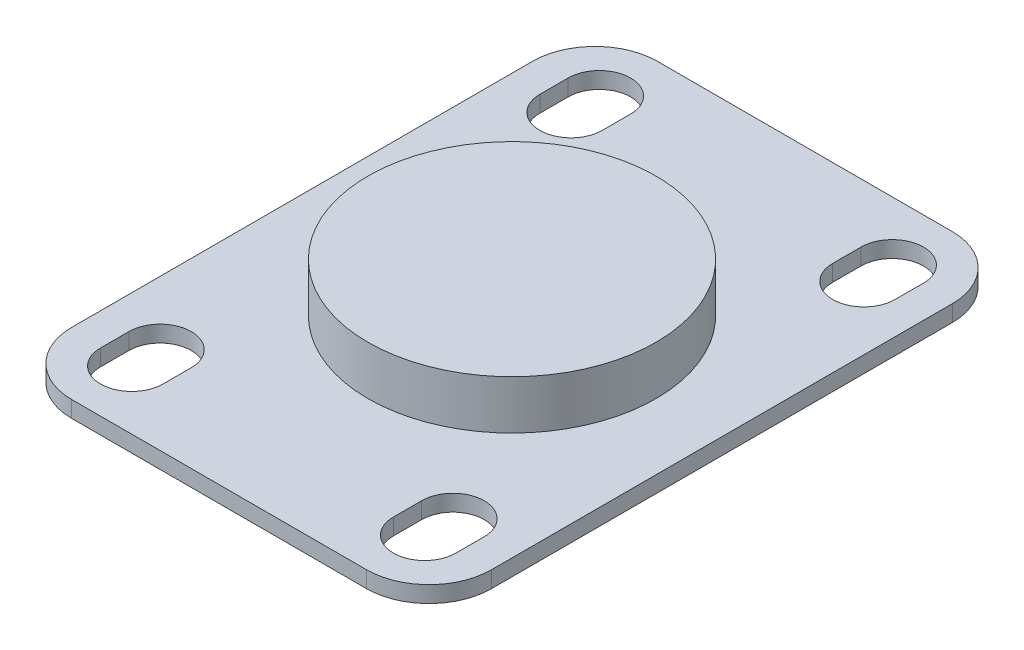
ISO-10303-21;
HEADER;
FILE_DESCRIPTION(('STEP AP214'),'2;1');
FILE_NAME('part.step','',(''),(''),'','','');
FILE_SCHEMA(('AUTOMOTIVE_DESIGN { 1 0 10303 214 1 1 1 1 }'));
ENDSEC;
DATA;
#1=APPLICATION_CONTEXT('core data for automotive mechanical design processes');
#2=APPLICATION_PROTOCOL_DEFINITION('international standard','automotive_design',2000,#1);
#3=PRODUCT_CONTEXT('',#1,'mechanical');
#4=PRODUCT('Part','Part','',(#3));
#5=PRODUCT_RELATED_PRODUCT_CATEGORY('part','',(#4));
#6=PRODUCT_DEFINITION_FORMATION('','',#4);
#7=PRODUCT_DEFINITION_CONTEXT('part definition',#1,'design');
#8=PRODUCT_DEFINITION('design','',#6,#7);
#9=PRODUCT_DEFINITION_SHAPE('','',#8);
#10=(LENGTH_UNIT() NAMED_UNIT(*) SI_UNIT(.MILLI.,.METRE.));
#11=(NAMED_UNIT(*) PLANE_ANGLE_UNIT() SI_UNIT($,.RADIAN.));
#12=(NAMED_UNIT(*) SI_UNIT($,.STERADIAN.) SOLID_ANGLE_UNIT());
#13=UNCERTAINTY_MEASURE_WITH_UNIT(LENGTH_MEASURE(1.E-05),#10,'distance_accuracy_value','');
#14=(GEOMETRIC_REPRESENTATION_CONTEXT(3) GLOBAL_UNCERTAINTY_ASSIGNED_CONTEXT((#13)) GLOBAL_UNIT_ASSIGNED_CONTEXT((#10,
#11,#12)) REPRESENTATION_CONTEXT('',''));
#15=CARTESIAN_POINT('',(0.,0.,0.));
#16=DIRECTION('',(0.,0.,1.));
#17=DIRECTION('',(1.,0.,0.));
#18=AXIS2_PLACEMENT_3D('',#15,#16,#17);
#19=CARTESIAN_POINT('',(-15.,1.68,-21.05));
#20=DIRECTION('',(0.,-1.,0.));
#21=DIRECTION('',(0.,0.,-1.));
#22=AXIS2_PLACEMENT_3D('',#19,#20,#21);
#23=CYLINDRICAL_SURFACE('',#22,3.2);
#24=CARTESIAN_POINT('',(-15.,0.,-21.05));
#25=DIRECTION('',(0.,1.,0.));
#26=DIRECTION('',(0.,0.,1.));
#27=AXIS2_PLACEMENT_3D('',#24,#25,#26);
#28=CIRCLE('',#27,3.2);
#29=CARTESIAN_POINT('',(-18.2,0.,-21.05));
#30=VERTEX_POINT('',#29);
#31=CARTESIAN_POINT('',(-11.8,0.,-21.05));
#32=VERTEX_POINT('',#31);
#33=EDGE_CURVE('E344',#30,#32,#28,.T.);
#34=ORIENTED_EDGE('',*,*,#33,.F.);
#35=DIRECTION('',(0.,-1.,0.));
#36=VECTOR('',#35,1.);
#37=CARTESIAN_POINT('',(-18.2,1.68,-21.05));
#38=LINE('',#37,#36);
#39=CARTESIAN_POINT('',(-18.2,1.68,-21.05));
#40=VERTEX_POINT('',#39);
#41=EDGE_CURVE('E11',#40,#30,#38,.T.);
#42=ORIENTED_EDGE('',*,*,#41,.F.);
#43=CARTESIAN_POINT('',(-15.,1.68,-21.05));
#44=DIRECTION('',(0.,1.,0.));
#45=DIRECTION('',(0.,0.,1.));
#46=AXIS2_PLACEMENT_3D('',#43,#44,#45);
#47=CIRCLE('',#46,3.2);
#48=CARTESIAN_POINT('',(-11.8,1.68,-21.05));
#49=VERTEX_POINT('',#48);
#50=EDGE_CURVE('E218',#40,#49,#47,.T.);
#51=ORIENTED_EDGE('',*,*,#50,.T.);
#52=DIRECTION('',(0.,-1.,0.));
#53=VECTOR('',#52,1.);
#54=CARTESIAN_POINT('',(-11.8,1.68,-21.05));
#55=LINE('',#54,#53);
#56=EDGE_CURVE('E56',#49,#32,#55,.T.);
#57=ORIENTED_EDGE('',*,*,#56,.T.);
#58=EDGE_LOOP('',(#34,#42,#51,#57));
#59=FACE_BOUND('',#58,.T.);
#60=ADVANCED_FACE('F37',(#59),#23,.F.);
#61=CARTESIAN_POINT('',(-18.2,1.68,0.));
#62=DIRECTION('',(-1.,0.,0.));
#63=DIRECTION('',(0.,0.,1.));
#64=AXIS2_PLACEMENT_3D('',#61,#62,#63);
#65=PLANE('',#64);
#66=DIRECTION('',(0.,0.,-1.));
#67=VECTOR('',#66,1.);
#68=CARTESIAN_POINT('',(-18.2,0.,0.));
#69=LINE('',#68,#67);
#70=CARTESIAN_POINT('',(-18.2,0.,-23.95));
#71=VERTEX_POINT('',#70);
#72=EDGE_CURVE('E223',#30,#71,#69,.T.);
#73=ORIENTED_EDGE('',*,*,#72,.T.);
#74=DIRECTION('',(0.,-1.,0.));
#75=VECTOR('',#74,1.);
#76=CARTESIAN_POINT('',(-18.2,1.68,-23.95));
#77=LINE('',#76,#75);
#78=CARTESIAN_POINT('',(-18.2,1.68,-23.95));
#79=VERTEX_POINT('',#78);
#80=EDGE_CURVE('E47',#79,#71,#77,.T.);
#81=ORIENTED_EDGE('',*,*,#80,.F.);
#82=DIRECTION('',(0.,0.,-1.));
#83=VECTOR('',#82,1.);
#84=CARTESIAN_POINT('',(-18.2,1.68,0.));
#85=LINE('',#84,#83);
#86=EDGE_CURVE('E213',#40,#79,#85,.T.);
#87=ORIENTED_EDGE('',*,*,#86,.F.);
#88=ORIENTED_EDGE('',*,*,#41,.T.);
#89=EDGE_LOOP('',(#73,#81,#87,#88));
#90=FACE_BOUND('',#89,.T.);
#91=ADVANCED_FACE('F221',(#90),#65,.F.);
#92=CARTESIAN_POINT('',(-15.,1.68,-23.95));
#93=DIRECTION('',(0.,-1.,0.));
#94=DIRECTION('',(0.,0.,-1.));
#95=AXIS2_PLACEMENT_3D('',#92,#93,#94);
#96=CYLINDRICAL_SURFACE('',#95,3.2);
#97=CARTESIAN_POINT('',(-15.,0.,-23.95));
#98=DIRECTION('',(0.,1.,0.));
#99=DIRECTION('',(0.,0.,1.));
#100=AXIS2_PLACEMENT_3D('',#97,#98,#99);
#101=CIRCLE('',#100,3.2);
#102=CARTESIAN_POINT('',(-11.8,0.,-23.95));
#103=VERTEX_POINT('',#102);
#104=EDGE_CURVE('E347',#71,#103,#101,.F.);
#105=ORIENTED_EDGE('',*,*,#104,.T.);
#106=DIRECTION('',(0.,-1.,0.));
#107=VECTOR('',#106,1.);
#108=CARTESIAN_POINT('',(-11.8,1.68,-23.95));
#109=LINE('',#108,#107);
#110=CARTESIAN_POINT('',(-11.8,1.68,-23.95));
#111=VERTEX_POINT('',#110);
#112=EDGE_CURVE('E130',#111,#103,#109,.T.);
#113=ORIENTED_EDGE('',*,*,#112,.F.);
#114=CARTESIAN_POINT('',(-15.,1.68,-23.95));
#115=DIRECTION('',(0.,1.,0.));
#116=DIRECTION('',(0.,0.,1.));
#117=AXIS2_PLACEMENT_3D('',#114,#115,#116);
#118=CIRCLE('',#117,3.2);
#119=EDGE_CURVE('E205',#79,#111,#118,.F.);
#120=ORIENTED_EDGE('',*,*,#119,.F.);
#121=ORIENTED_EDGE('',*,*,#80,.T.);
#122=EDGE_LOOP('',(#105,#113,#120,#121));
#123=FACE_BOUND('',#122,.T.);
#124=ADVANCED_FACE('F207',(#123),#96,.F.);
#125=CARTESIAN_POINT('',(15.,1.68,-23.95));
#126=DIRECTION('',(0.,-1.,0.));
#127=DIRECTION('',(0.,0.,-1.));
#128=AXIS2_PLACEMENT_3D('',#125,#126,#127);
#129=CYLINDRICAL_SURFACE('',#128,3.2);
#130=CARTESIAN_POINT('',(15.,0.,-23.95));
#131=DIRECTION('',(0.,1.,0.));
#132=DIRECTION('',(0.,0.,1.));
#133=AXIS2_PLACEMENT_3D('',#130,#131,#132);
#134=CIRCLE('',#133,3.2);
#135=CARTESIAN_POINT('',(18.2,0.,-23.95));
#136=VERTEX_POINT('',#135);
#137=CARTESIAN_POINT('',(11.8,0.,-23.95));
#138=VERTEX_POINT('',#137);
#139=EDGE_CURVE('E332',#136,#138,#134,.T.);
#140=ORIENTED_EDGE('',*,*,#139,.F.);
#141=DIRECTION('',(0.,-1.,0.));
#142=VECTOR('',#141,1.);
#143=CARTESIAN_POINT('',(18.2,1.68,-23.95));
#144=LINE('',#143,#142);
#145=CARTESIAN_POINT('',(18.2,1.68,-23.95));
#146=VERTEX_POINT('',#145);
#147=EDGE_CURVE('E236',#146,#136,#144,.T.);
#148=ORIENTED_EDGE('',*,*,#147,.F.);
#149=CARTESIAN_POINT('',(15.,1.68,-23.95));
#150=DIRECTION('',(0.,1.,0.));
#151=DIRECTION('',(0.,0.,1.));
#152=AXIS2_PLACEMENT_3D('',#149,#150,#151);
#153=CIRCLE('',#152,3.2);
#154=CARTESIAN_POINT('',(11.8,1.68,-23.95));
#155=VERTEX_POINT('',#154);
#156=EDGE_CURVE('E395',#146,#155,#153,.T.);
#157=ORIENTED_EDGE('',*,*,#156,.T.);
#158=DIRECTION('',(0.,-1.,0.));
#159=VECTOR('',#158,1.);
#160=CARTESIAN_POINT('',(11.8,1.68,-23.95));
#161=LINE('',#160,#159);
#162=EDGE_CURVE('E228',#155,#138,#161,.T.);
#163=ORIENTED_EDGE('',*,*,#162,.T.);
#164=EDGE_LOOP('',(#140,#148,#157,#163));
#165=FACE_BOUND('',#164,.T.);
#166=ADVANCED_FACE('F442',(#165),#129,.F.);
#167=CARTESIAN_POINT('',(18.2,1.68,0.));
#168=DIRECTION('',(-1.,0.,0.));
#169=DIRECTION('',(0.,0.,1.));
#170=AXIS2_PLACEMENT_3D('',#167,#168,#169);
#171=PLANE('',#170);
#172=DIRECTION('',(0.,0.,-1.));
#173=VECTOR('',#172,1.);
#174=CARTESIAN_POINT('',(18.2,0.,0.));
#175=LINE('',#174,#173);
#176=CARTESIAN_POINT('',(18.2,0.,-21.05));
#177=VERTEX_POINT('',#176);
#178=EDGE_CURVE('E335',#177,#136,#175,.T.);
#179=ORIENTED_EDGE('',*,*,#178,.F.);
#180=DIRECTION('',(0.,-1.,0.));
#181=VECTOR('',#180,1.);
#182=CARTESIAN_POINT('',(18.2,1.68,-21.05));
#183=LINE('',#182,#181);
#184=CARTESIAN_POINT('',(18.2,1.68,-21.05));
#185=VERTEX_POINT('',#184);
#186=EDGE_CURVE('E234',#185,#177,#183,.T.);
#187=ORIENTED_EDGE('',*,*,#186,.F.);
#188=DIRECTION('',(0.,0.,-1.));
#189=VECTOR('',#188,1.);
#190=CARTESIAN_POINT('',(18.2,1.68,0.));
#191=LINE('',#190,#189);
#192=EDGE_CURVE('E398',#185,#146,#191,.T.);
#193=ORIENTED_EDGE('',*,*,#192,.T.);
#194=ORIENTED_EDGE('',*,*,#147,.T.);
#195=EDGE_LOOP('',(#179,#187,#193,#194));
#196=FACE_BOUND('',#195,.T.);
#197=ADVANCED_FACE('F438',(#196),#171,.T.);
#198=CARTESIAN_POINT('',(15.,1.68,-21.05));
#199=DIRECTION('',(0.,-1.,0.));
#200=DIRECTION('',(0.,0.,-1.));
#201=AXIS2_PLACEMENT_3D('',#198,#199,#200);
#202=CYLINDRICAL_SURFACE('',#201,3.2);
#203=CARTESIAN_POINT('',(15.,0.,-21.05));
#204=DIRECTION('',(0.,1.,0.));
#205=DIRECTION('',(0.,0.,1.));
#206=AXIS2_PLACEMENT_3D('',#203,#204,#205);
#207=CIRCLE('',#206,3.2);
#208=CARTESIAN_POINT('',(11.8,0.,-21.05));
#209=VERTEX_POINT('',#208);
#210=EDGE_CURVE('E338',#177,#209,#207,.F.);
#211=ORIENTED_EDGE('',*,*,#210,.T.);
#212=DIRECTION('',(0.,-1.,0.));
#213=VECTOR('',#212,1.);
#214=CARTESIAN_POINT('',(11.8,1.68,-21.05));
#215=LINE('',#214,#213);
#216=CARTESIAN_POINT('',(11.8,1.68,-21.05));
#217=VERTEX_POINT('',#216);
#218=EDGE_CURVE('E230',#217,#209,#215,.T.);
#219=ORIENTED_EDGE('',*,*,#218,.F.);
#220=CARTESIAN_POINT('',(15.,1.68,-21.05));
#221=DIRECTION('',(0.,1.,0.));
#222=DIRECTION('',(0.,0.,1.));
#223=AXIS2_PLACEMENT_3D('',#220,#221,#222);
#224=CIRCLE('',#223,3.2);
#225=EDGE_CURVE('E401',#185,#217,#224,.F.);
#226=ORIENTED_EDGE('',*,*,#225,.F.);
#227=ORIENTED_EDGE('',*,*,#186,.T.);
#228=EDGE_LOOP('',(#211,#219,#226,#227));
#229=FACE_BOUND('',#228,.T.);
#230=ADVANCED_FACE('F434',(#229),#202,.F.);
#231=CARTESIAN_POINT('',(15.,1.68,21.05));
#232=DIRECTION('',(0.,-1.,0.));
#233=DIRECTION('',(0.,0.,-1.));
#234=AXIS2_PLACEMENT_3D('',#231,#232,#233);
#235=CYLINDRICAL_SURFACE('',#234,3.2);
#236=CARTESIAN_POINT('',(15.,0.,21.05));
#237=DIRECTION('',(0.,1.,0.));
#238=DIRECTION('',(0.,0.,1.));
#239=AXIS2_PLACEMENT_3D('',#236,#237,#238);
#240=CIRCLE('',#239,3.2);
#241=CARTESIAN_POINT('',(18.2,0.,21.05));
#242=VERTEX_POINT('',#241);
#243=CARTESIAN_POINT('',(11.8,0.,21.05));
#244=VERTEX_POINT('',#243);
#245=EDGE_CURVE('E320',#242,#244,#240,.T.);
#246=ORIENTED_EDGE('',*,*,#245,.F.);
#247=DIRECTION('',(0.,-1.,0.));
#248=VECTOR('',#247,1.);
#249=CARTESIAN_POINT('',(18.2,1.68,21.05));
#250=LINE('',#249,#248);
#251=CARTESIAN_POINT('',(18.2,1.68,21.05));
#252=VERTEX_POINT('',#251);
#253=EDGE_CURVE('E231',#252,#242,#250,.T.);
#254=ORIENTED_EDGE('',*,*,#253,.F.);
#255=CARTESIAN_POINT('',(15.,1.68,21.05));
#256=DIRECTION('',(0.,1.,0.));
#257=DIRECTION('',(0.,0.,1.));
#258=AXIS2_PLACEMENT_3D('',#255,#256,#257);
#259=CIRCLE('',#258,3.2);
#260=CARTESIAN_POINT('',(11.8,1.68,21.05));
#261=VERTEX_POINT('',#260);
#262=EDGE_CURVE('E384',#252,#261,#259,.T.);
#263=ORIENTED_EDGE('',*,*,#262,.T.);
#264=DIRECTION('',(0.,-1.,0.));
#265=VECTOR('',#264,1.);
#266=CARTESIAN_POINT('',(11.8,1.68,21.05));
#267=LINE('',#266,#265);
#268=EDGE_CURVE('E238',#261,#244,#267,.T.);
#269=ORIENTED_EDGE('',*,*,#268,.T.);
#270=EDGE_LOOP('',(#246,#254,#263,#269));
#271=FACE_BOUND('',#270,.T.);
#272=ADVANCED_FACE('F437',(#271),#235,.F.);
#273=CARTESIAN_POINT('',(18.2,1.68,0.));
#274=DIRECTION('',(1.,0.,0.));
#275=DIRECTION('',(0.,0.,-1.));
#276=AXIS2_PLACEMENT_3D('',#273,#274,#275);
#277=PLANE('',#276);
#278=DIRECTION('',(0.,0.,1.));
#279=VECTOR('',#278,1.);
#280=CARTESIAN_POINT('',(18.2,0.,0.));
#281=LINE('',#280,#279);
#282=CARTESIAN_POINT('',(18.2,0.,23.95));
#283=VERTEX_POINT('',#282);
#284=EDGE_CURVE('E323',#242,#283,#281,.T.);
#285=ORIENTED_EDGE('',*,*,#284,.T.);
#286=DIRECTION('',(0.,-1.,0.));
#287=VECTOR('',#286,1.);
#288=CARTESIAN_POINT('',(18.2,1.68,23.95));
#289=LINE('',#288,#287);
#290=CARTESIAN_POINT('',(18.2,1.68,23.95));
#291=VERTEX_POINT('',#290);
#292=EDGE_CURVE('E243',#291,#283,#289,.T.);
#293=ORIENTED_EDGE('',*,*,#292,.F.);
#294=DIRECTION('',(0.,0.,1.));
#295=VECTOR('',#294,1.);
#296=CARTESIAN_POINT('',(18.2,1.68,0.));
#297=LINE('',#296,#295);
#298=EDGE_CURVE('E387',#252,#291,#297,.T.);
#299=ORIENTED_EDGE('',*,*,#298,.F.);
#300=ORIENTED_EDGE('',*,*,#253,.T.);
#301=EDGE_LOOP('',(#285,#293,#299,#300));
#302=FACE_BOUND('',#301,.T.);
#303=ADVANCED_FACE('F454',(#302),#277,.F.);
#304=CARTESIAN_POINT('',(15.,1.68,23.95));
#305=DIRECTION('',(0.,-1.,0.));
#306=DIRECTION('',(0.,0.,-1.));
#307=AXIS2_PLACEMENT_3D('',#304,#305,#306);
#308=CYLINDRICAL_SURFACE('',#307,3.2);
#309=CARTESIAN_POINT('',(15.,0.,23.95));
#310=DIRECTION('',(0.,1.,0.));
#311=DIRECTION('',(0.,0.,1.));
#312=AXIS2_PLACEMENT_3D('',#309,#310,#311);
#313=CIRCLE('',#312,3.2);
#314=CARTESIAN_POINT('',(11.8,0.,23.95));
#315=VERTEX_POINT('',#314);
#316=EDGE_CURVE('E326',#283,#315,#313,.F.);
#317=ORIENTED_EDGE('',*,*,#316,.T.);
#318=DIRECTION('',(0.,-1.,0.));
#319=VECTOR('',#318,1.);
#320=CARTESIAN_POINT('',(11.8,1.68,23.95));
#321=LINE('',#320,#319);
#322=CARTESIAN_POINT('',(11.8,1.68,23.95));
#323=VERTEX_POINT('',#322);
#324=EDGE_CURVE('E240',#323,#315,#321,.T.);
#325=ORIENTED_EDGE('',*,*,#324,.F.);
#326=CARTESIAN_POINT('',(15.,1.68,23.95));
#327=DIRECTION('',(0.,1.,0.));
#328=DIRECTION('',(0.,0.,1.));
#329=AXIS2_PLACEMENT_3D('',#326,#327,#328);
#330=CIRCLE('',#329,3.2);
#331=EDGE_CURVE('E390',#291,#323,#330,.F.);
#332=ORIENTED_EDGE('',*,*,#331,.F.);
#333=ORIENTED_EDGE('',*,*,#292,.T.);
#334=EDGE_LOOP('',(#317,#325,#332,#333));
#335=FACE_BOUND('',#334,.T.);
#336=ADVANCED_FACE('F450',(#335),#308,.F.);
#337=CARTESIAN_POINT('',(-15.,1.68,23.95));
#338=DIRECTION('',(0.,-1.,0.));
#339=DIRECTION('',(0.,0.,-1.));
#340=AXIS2_PLACEMENT_3D('',#337,#338,#339);
#341=CYLINDRICAL_SURFACE('',#340,3.2);
#342=CARTESIAN_POINT('',(-15.,0.,23.95));
#343=DIRECTION('',(0.,1.,0.));
#344=DIRECTION('',(0.,0.,1.));
#345=AXIS2_PLACEMENT_3D('',#342,#343,#344);
#346=CIRCLE('',#345,3.2);
#347=CARTESIAN_POINT('',(-18.2,0.,23.95));
#348=VERTEX_POINT('',#347);
#349=CARTESIAN_POINT('',(-11.8,0.,23.95));
#350=VERTEX_POINT('',#349);
#351=EDGE_CURVE('E308',#348,#350,#346,.T.);
#352=ORIENTED_EDGE('',*,*,#351,.F.);
#353=DIRECTION('',(0.,-1.,0.));
#354=VECTOR('',#353,1.);
#355=CARTESIAN_POINT('',(-18.2,1.68,23.95));
#356=LINE('',#355,#354);
#357=CARTESIAN_POINT('',(-18.2,1.68,23.95));
#358=VERTEX_POINT('',#357);
#359=EDGE_CURVE('E241',#358,#348,#356,.T.);
#360=ORIENTED_EDGE('',*,*,#359,.F.);
#361=CARTESIAN_POINT('',(-15.,1.68,23.95));
#362=DIRECTION('',(0.,1.,0.));
#363=DIRECTION('',(0.,0.,1.));
#364=AXIS2_PLACEMENT_3D('',#361,#362,#363);
#365=CIRCLE('',#364,3.2);
#366=CARTESIAN_POINT('',(-11.8,1.68,23.95));
#367=VERTEX_POINT('',#366);
#368=EDGE_CURVE('E373',#358,#367,#365,.T.);
#369=ORIENTED_EDGE('',*,*,#368,.T.);
#370=DIRECTION('',(0.,-1.,0.));
#371=VECTOR('',#370,1.);
#372=CARTESIAN_POINT('',(-11.8,1.68,23.95));
#373=LINE('',#372,#371);
#374=EDGE_CURVE('E247',#367,#350,#373,.T.);
#375=ORIENTED_EDGE('',*,*,#374,.T.);
#376=EDGE_LOOP('',(#352,#360,#369,#375));
#377=FACE_BOUND('',#376,.T.);
#378=ADVANCED_FACE('F453',(#377),#341,.F.);
#379=CARTESIAN_POINT('',(-18.2,1.68,0.));
#380=DIRECTION('',(1.,0.,0.));
#381=DIRECTION('',(0.,0.,-1.));
#382=AXIS2_PLACEMENT_3D('',#379,#380,#381);
#383=PLANE('',#382);
#384=DIRECTION('',(0.,0.,1.));
#385=VECTOR('',#384,1.);
#386=CARTESIAN_POINT('',(-18.2,0.,0.));
#387=LINE('',#386,#385);
#388=CARTESIAN_POINT('',(-18.2,0.,21.05));
#389=VERTEX_POINT('',#388);
#390=EDGE_CURVE('E311',#389,#348,#387,.T.);
#391=ORIENTED_EDGE('',*,*,#390,.F.);
#392=DIRECTION('',(0.,-1.,0.));
#393=VECTOR('',#392,1.);
#394=CARTESIAN_POINT('',(-18.2,1.68,21.05));
#395=LINE('',#394,#393);
#396=CARTESIAN_POINT('',(-18.2,1.68,21.05));
#397=VERTEX_POINT('',#396);
#398=EDGE_CURVE('E252',#397,#389,#395,.T.);
#399=ORIENTED_EDGE('',*,*,#398,.F.);
#400=DIRECTION('',(0.,0.,1.));
#401=VECTOR('',#400,1.);
#402=CARTESIAN_POINT('',(-18.2,1.68,0.));
#403=LINE('',#402,#401);
#404=EDGE_CURVE('E376',#397,#358,#403,.T.);
#405=ORIENTED_EDGE('',*,*,#404,.T.);
#406=ORIENTED_EDGE('',*,*,#359,.T.);
#407=EDGE_LOOP('',(#391,#399,#405,#406));
#408=FACE_BOUND('',#407,.T.);
#409=ADVANCED_FACE('F468',(#408),#383,.T.);
#410=CARTESIAN_POINT('',(-15.,1.68,21.05));
#411=DIRECTION('',(0.,-1.,0.));
#412=DIRECTION('',(0.,0.,-1.));
#413=AXIS2_PLACEMENT_3D('',#410,#411,#412);
#414=CYLINDRICAL_SURFACE('',#413,3.2);
#415=CARTESIAN_POINT('',(-15.,0.,21.05));
#416=DIRECTION('',(0.,1.,0.));
#417=DIRECTION('',(0.,0.,1.));
#418=AXIS2_PLACEMENT_3D('',#415,#416,#417);
#419=CIRCLE('',#418,3.2);
#420=CARTESIAN_POINT('',(-11.8,0.,21.05));
#421=VERTEX_POINT('',#420);
#422=EDGE_CURVE('E314',#389,#421,#419,.F.);
#423=ORIENTED_EDGE('',*,*,#422,.T.);
#424=DIRECTION('',(0.,-1.,0.));
#425=VECTOR('',#424,1.);
#426=CARTESIAN_POINT('',(-11.8,1.68,21.05));
#427=LINE('',#426,#425);
#428=CARTESIAN_POINT('',(-11.8,1.68,21.05));
#429=VERTEX_POINT('',#428);
#430=EDGE_CURVE('E249',#429,#421,#427,.T.);
#431=ORIENTED_EDGE('',*,*,#430,.F.);
#432=CARTESIAN_POINT('',(-15.,1.68,21.05));
#433=DIRECTION('',(0.,1.,0.));
#434=DIRECTION('',(0.,0.,1.));
#435=AXIS2_PLACEMENT_3D('',#432,#433,#434);
#436=CIRCLE('',#435,3.2);
#437=EDGE_CURVE('E379',#397,#429,#436,.F.);
#438=ORIENTED_EDGE('',*,*,#437,.F.);
#439=ORIENTED_EDGE('',*,*,#398,.T.);
#440=EDGE_LOOP('',(#423,#431,#438,#439));
#441=FACE_BOUND('',#440,.T.);
#442=ADVANCED_FACE('F465',(#441),#414,.F.);
#443=CARTESIAN_POINT('',(-15.1,1.68,-23.6));
#444=DIRECTION('',(0.,-1.,0.));
#445=DIRECTION('',(0.,0.,-1.));
#446=AXIS2_PLACEMENT_3D('',#443,#444,#445);
#447=CYLINDRICAL_SURFACE('',#446,6.4);
#448=CARTESIAN_POINT('',(-15.1,0.,-23.6));
#449=DIRECTION('',(0.,1.,0.));
#450=DIRECTION('',(0.,0.,1.));
#451=AXIS2_PLACEMENT_3D('',#448,#449,#450);
#452=CIRCLE('',#451,6.4);
#453=CARTESIAN_POINT('',(-21.5,0.,-23.5999999999999));
#454=VERTEX_POINT('',#453);
#455=CARTESIAN_POINT('',(-15.0999999999999,0.,-30.));
#456=VERTEX_POINT('',#455);
#457=EDGE_CURVE('E283',#454,#456,#452,.F.);
#458=ORIENTED_EDGE('',*,*,#457,.F.);
#459=DIRECTION('',(0.,-1.,0.));
#460=VECTOR('',#459,1.);
#461=CARTESIAN_POINT('',(-21.5,1.68,-23.5999999999999));
#462=LINE('',#461,#460);
#463=CARTESIAN_POINT('',(-21.5,1.68,-23.5999999999999));
#464=VERTEX_POINT('',#463);
#465=EDGE_CURVE('E41',#464,#454,#462,.T.);
#466=ORIENTED_EDGE('',*,*,#465,.F.);
#467=CARTESIAN_POINT('',(-15.1,1.68,-23.6));
#468=DIRECTION('',(0.,1.,0.));
#469=DIRECTION('',(0.,0.,1.));
#470=AXIS2_PLACEMENT_3D('',#467,#468,#469);
#471=CIRCLE('',#470,6.4);
#472=CARTESIAN_POINT('',(-15.0999999999999,1.68,-30.));
#473=VERTEX_POINT('',#472);
#474=EDGE_CURVE('E351',#464,#473,#471,.F.);
#475=ORIENTED_EDGE('',*,*,#474,.T.);
#476=DIRECTION('',(0.,-1.,0.));
#477=VECTOR('',#476,1.);
#478=CARTESIAN_POINT('',(-15.0999999999999,1.68,-30.));
#479=LINE('',#478,#477);
#480=EDGE_CURVE('E255',#473,#456,#479,.T.);
#481=ORIENTED_EDGE('',*,*,#480,.T.);
#482=EDGE_LOOP('',(#458,#466,#475,#481));
#483=FACE_BOUND('',#482,.T.);
#484=ADVANCED_FACE('F39',(#483),#447,.T.);
#485=CARTESIAN_POINT('',(-21.5,1.68,0.));
#486=DIRECTION('',(-1.,0.,0.));
#487=DIRECTION('',(0.,0.,1.));
#488=AXIS2_PLACEMENT_3D('',#485,#486,#487);
#489=PLANE('',#488);
#490=DIRECTION('',(0.,0.,-1.));
#491=VECTOR('',#490,1.);
#492=CARTESIAN_POINT('',(-21.5,0.,0.));
#493=LINE('',#492,#491);
#494=CARTESIAN_POINT('',(-21.5,0.,23.6));
#495=VERTEX_POINT('',#494);
#496=EDGE_CURVE('E279',#495,#454,#493,.T.);
#497=ORIENTED_EDGE('',*,*,#496,.F.);
#498=DIRECTION('',(0.,-1.,0.));
#499=VECTOR('',#498,1.);
#500=CARTESIAN_POINT('',(-21.5,1.68,23.6));
#501=LINE('',#500,#499);
#502=CARTESIAN_POINT('',(-21.5,1.68,23.6));
#503=VERTEX_POINT('',#502);
#504=EDGE_CURVE('E270',#503,#495,#501,.T.);
#505=ORIENTED_EDGE('',*,*,#504,.F.);
#506=DIRECTION('',(0.,0.,-1.));
#507=VECTOR('',#506,1.);
#508=CARTESIAN_POINT('',(-21.5,1.68,0.));
#509=LINE('',#508,#507);
#510=EDGE_CURVE('E281',#503,#464,#509,.T.);
#511=ORIENTED_EDGE('',*,*,#510,.T.);
#512=ORIENTED_EDGE('',*,*,#465,.T.);
#513=EDGE_LOOP('',(#497,#505,#511,#512));
#514=FACE_BOUND('',#513,.T.);
#515=ADVANCED_FACE('F277',(#514),#489,.T.);
#516=CARTESIAN_POINT('',(-15.1,1.68,23.6));
#517=DIRECTION('',(0.,-1.,0.));
#518=DIRECTION('',(0.,0.,-1.));
#519=AXIS2_PLACEMENT_3D('',#516,#517,#518);
#520=CYLINDRICAL_SURFACE('',#519,6.4);
#521=CARTESIAN_POINT('',(-15.1,0.,23.6));
#522=DIRECTION('',(0.,1.,0.));
#523=DIRECTION('',(0.,0.,1.));
#524=AXIS2_PLACEMENT_3D('',#521,#522,#523);
#525=CIRCLE('',#524,6.4);
#526=CARTESIAN_POINT('',(-15.0999999999999,0.,30.));
#527=VERTEX_POINT('',#526);
#528=EDGE_CURVE('E292',#495,#527,#525,.T.);
#529=ORIENTED_EDGE('',*,*,#528,.T.);
#530=DIRECTION('',(0.,-1.,0.));
#531=VECTOR('',#530,1.);
#532=CARTESIAN_POINT('',(-15.0999999999999,1.68,30.));
#533=LINE('',#532,#531);
#534=CARTESIAN_POINT('',(-15.0999999999999,1.68,30.));
#535=VERTEX_POINT('',#534);
#536=EDGE_CURVE('E268',#535,#527,#533,.T.);
#537=ORIENTED_EDGE('',*,*,#536,.F.);
#538=CARTESIAN_POINT('',(-15.1,1.68,23.6));
#539=DIRECTION('',(0.,1.,0.));
#540=DIRECTION('',(0.,0.,1.));
#541=AXIS2_PLACEMENT_3D('',#538,#539,#540);
#542=CIRCLE('',#541,6.4);
#543=EDGE_CURVE('E355',#503,#535,#542,.T.);
#544=ORIENTED_EDGE('',*,*,#543,.F.);
#545=ORIENTED_EDGE('',*,*,#504,.T.);
#546=EDGE_LOOP('',(#529,#537,#544,#545));
#547=FACE_BOUND('',#546,.T.);
#548=ADVANCED_FACE('F490',(#547),#520,.T.);
#549=CARTESIAN_POINT('',(0.,1.68,30.));
#550=DIRECTION('',(0.,0.,-1.));
#551=DIRECTION('',(-1.,0.,0.));
#552=AXIS2_PLACEMENT_3D('',#549,#550,#551);
#553=PLANE('',#552);
#554=DIRECTION('',(1.,0.,0.));
#555=VECTOR('',#554,1.);
#556=CARTESIAN_POINT('',(0.,0.,30.));
#557=LINE('',#556,#555);
#558=CARTESIAN_POINT('',(15.1,0.,30.));
#559=VERTEX_POINT('',#558);
#560=EDGE_CURVE('E294',#527,#559,#557,.T.);
#561=ORIENTED_EDGE('',*,*,#560,.T.);
#562=DIRECTION('',(0.,-1.,0.));
#563=VECTOR('',#562,1.);
#564=CARTESIAN_POINT('',(15.1,1.68,30.));
#565=LINE('',#564,#563);
#566=CARTESIAN_POINT('',(15.1,1.68,30.));
#567=VERTEX_POINT('',#566);
#568=EDGE_CURVE('E265',#567,#559,#565,.T.);
#569=ORIENTED_EDGE('',*,*,#568,.F.);
#570=DIRECTION('',(1.,0.,0.));
#571=VECTOR('',#570,1.);
#572=CARTESIAN_POINT('',(0.,1.68,30.));
#573=LINE('',#572,#571);
#574=EDGE_CURVE('E362',#535,#567,#573,.T.);
#575=ORIENTED_EDGE('',*,*,#574,.F.);
#576=ORIENTED_EDGE('',*,*,#536,.T.);
#577=EDGE_LOOP('',(#561,#569,#575,#576));
#578=FACE_BOUND('',#577,.T.);
#579=ADVANCED_FACE('F486',(#578),#553,.F.);
#580=CARTESIAN_POINT('',(15.1,1.68,23.6));
#581=DIRECTION('',(0.,-1.,0.));
#582=DIRECTION('',(0.,0.,-1.));
#583=AXIS2_PLACEMENT_3D('',#580,#581,#582);
#584=CYLINDRICAL_SURFACE('',#583,6.4);
#585=CARTESIAN_POINT('',(15.1,0.,23.6));
#586=DIRECTION('',(0.,1.,0.));
#587=DIRECTION('',(0.,0.,1.));
#588=AXIS2_PLACEMENT_3D('',#585,#586,#587);
#589=CIRCLE('',#588,6.4);
#590=CARTESIAN_POINT('',(21.5,0.,23.6));
#591=VERTEX_POINT('',#590);
#592=EDGE_CURVE('E299',#559,#591,#589,.T.);
#593=ORIENTED_EDGE('',*,*,#592,.T.);
#594=DIRECTION('',(0.,-1.,0.));
#595=VECTOR('',#594,1.);
#596=CARTESIAN_POINT('',(21.5,1.68,23.6));
#597=LINE('',#596,#595);
#598=CARTESIAN_POINT('',(21.5,1.68,23.6));
#599=VERTEX_POINT('',#598);
#600=EDGE_CURVE('E262',#599,#591,#597,.T.);
#601=ORIENTED_EDGE('',*,*,#600,.F.);
#602=CARTESIAN_POINT('',(15.1,1.68,23.6));
#603=DIRECTION('',(0.,1.,0.));
#604=DIRECTION('',(0.,0.,1.));
#605=AXIS2_PLACEMENT_3D('',#602,#603,#604);
#606=CIRCLE('',#605,6.4);
#607=EDGE_CURVE('E364',#567,#599,#606,.T.);
#608=ORIENTED_EDGE('',*,*,#607,.F.);
#609=ORIENTED_EDGE('',*,*,#568,.T.);
#610=EDGE_LOOP('',(#593,#601,#608,#609));
#611=FACE_BOUND('',#610,.T.);
#612=ADVANCED_FACE('F482',(#611),#584,.T.);
#613=CARTESIAN_POINT('',(21.5,1.68,0.));
#614=DIRECTION('',(-1.,0.,0.));
#615=DIRECTION('',(0.,0.,1.));
#616=AXIS2_PLACEMENT_3D('',#613,#614,#615);
#617=PLANE('',#616);
#618=DIRECTION('',(0.,0.,-1.));
#619=VECTOR('',#618,1.);
#620=CARTESIAN_POINT('',(21.5,0.,0.));
#621=LINE('',#620,#619);
#622=CARTESIAN_POINT('',(21.5,0.,-23.5999999999999));
#623=VERTEX_POINT('',#622);
#624=EDGE_CURVE('E301',#591,#623,#621,.T.);
#625=ORIENTED_EDGE('',*,*,#624,.T.);
#626=DIRECTION('',(0.,-1.,0.));
#627=VECTOR('',#626,1.);
#628=CARTESIAN_POINT('',(21.5,1.68,-23.5999999999999));
#629=LINE('',#628,#627);
#630=CARTESIAN_POINT('',(21.5,1.68,-23.5999999999999));
#631=VERTEX_POINT('',#630);
#632=EDGE_CURVE('E259',#631,#623,#629,.T.);
#633=ORIENTED_EDGE('',*,*,#632,.F.);
#634=DIRECTION('',(0.,0.,-1.));
#635=VECTOR('',#634,1.);
#636=CARTESIAN_POINT('',(21.5,1.68,0.));
#637=LINE('',#636,#635);
#638=EDGE_CURVE('E366',#599,#631,#637,.T.);
#639=ORIENTED_EDGE('',*,*,#638,.F.);
#640=ORIENTED_EDGE('',*,*,#600,.T.);
#641=EDGE_LOOP('',(#625,#633,#639,#640));
#642=FACE_BOUND('',#641,.T.);
#643=ADVANCED_FACE('F478',(#642),#617,.F.);
#644=CARTESIAN_POINT('',(15.1,1.68,-23.6));
#645=DIRECTION('',(0.,-1.,0.));
#646=DIRECTION('',(0.,0.,-1.));
#647=AXIS2_PLACEMENT_3D('',#644,#645,#646);
#648=CYLINDRICAL_SURFACE('',#647,6.4);
#649=CARTESIAN_POINT('',(15.1,0.,-23.6));
#650=DIRECTION('',(0.,1.,0.));
#651=DIRECTION('',(0.,0.,1.));
#652=AXIS2_PLACEMENT_3D('',#649,#650,#651);
#653=CIRCLE('',#652,6.4);
#654=CARTESIAN_POINT('',(15.1,0.,-30.));
#655=VERTEX_POINT('',#654);
#656=EDGE_CURVE('E303',#623,#655,#653,.T.);
#657=ORIENTED_EDGE('',*,*,#656,.T.);
#658=DIRECTION('',(0.,-1.,0.));
#659=VECTOR('',#658,1.);
#660=CARTESIAN_POINT('',(15.1,1.68,-30.));
#661=LINE('',#660,#659);
#662=CARTESIAN_POINT('',(15.1,1.68,-30.));
#663=VERTEX_POINT('',#662);
#664=EDGE_CURVE('E257',#663,#655,#661,.T.);
#665=ORIENTED_EDGE('',*,*,#664,.F.);
#666=CARTESIAN_POINT('',(15.1,1.68,-23.6));
#667=DIRECTION('',(0.,1.,0.));
#668=DIRECTION('',(0.,0.,1.));
#669=AXIS2_PLACEMENT_3D('',#666,#667,#668);
#670=CIRCLE('',#669,6.4);
#671=EDGE_CURVE('E368',#631,#663,#670,.T.);
#672=ORIENTED_EDGE('',*,*,#671,.F.);
#673=ORIENTED_EDGE('',*,*,#632,.T.);
#674=EDGE_LOOP('',(#657,#665,#672,#673));
#675=FACE_BOUND('',#674,.T.);
#676=ADVANCED_FACE('F432',(#675),#648,.T.);
#677=CARTESIAN_POINT('',(11.8,1.68,0.));
#678=DIRECTION('',(-1.,0.,0.));
#679=DIRECTION('',(0.,0.,1.));
#680=AXIS2_PLACEMENT_3D('',#677,#678,#679);
#681=PLANE('',#680);
#682=DIRECTION('',(0.,0.,-1.));
#683=VECTOR('',#682,1.);
#684=CARTESIAN_POINT('',(11.8,0.,0.));
#685=LINE('',#684,#683);
#686=EDGE_CURVE('E341',#209,#138,#685,.T.);
#687=ORIENTED_EDGE('',*,*,#686,.T.);
#688=ORIENTED_EDGE('',*,*,#162,.F.);
#689=DIRECTION('',(0.,0.,-1.));
#690=VECTOR('',#689,1.);
#691=CARTESIAN_POINT('',(11.8,1.68,0.));
#692=LINE('',#691,#690);
#693=EDGE_CURVE('E404',#217,#155,#692,.T.);
#694=ORIENTED_EDGE('',*,*,#693,.F.);
#695=ORIENTED_EDGE('',*,*,#218,.T.);
#696=EDGE_LOOP('',(#687,#688,#694,#695));
#697=FACE_BOUND('',#696,.T.);
#698=ADVANCED_FACE('F428',(#697),#681,.F.);
#699=CARTESIAN_POINT('',(11.8,1.68,0.));
#700=DIRECTION('',(1.,0.,0.));
#701=DIRECTION('',(0.,0.,-1.));
#702=AXIS2_PLACEMENT_3D('',#699,#700,#701);
#703=PLANE('',#702);
#704=DIRECTION('',(0.,0.,1.));
#705=VECTOR('',#704,1.);
#706=CARTESIAN_POINT('',(11.8,0.,0.));
#707=LINE('',#706,#705);
#708=EDGE_CURVE('E329',#244,#315,#707,.T.);
#709=ORIENTED_EDGE('',*,*,#708,.F.);
#710=ORIENTED_EDGE('',*,*,#268,.F.);
#711=DIRECTION('',(0.,0.,1.));
#712=VECTOR('',#711,1.);
#713=CARTESIAN_POINT('',(11.8,1.68,0.));
#714=LINE('',#713,#712);
#715=EDGE_CURVE('E392',#261,#323,#714,.T.);
#716=ORIENTED_EDGE('',*,*,#715,.T.);
#717=ORIENTED_EDGE('',*,*,#324,.T.);
#718=EDGE_LOOP('',(#709,#710,#716,#717));
#719=FACE_BOUND('',#718,.T.);
#720=ADVANCED_FACE('F431',(#719),#703,.T.);
#721=CARTESIAN_POINT('',(-11.8,1.68,0.));
#722=DIRECTION('',(1.,0.,0.));
#723=DIRECTION('',(0.,0.,-1.));
#724=AXIS2_PLACEMENT_3D('',#721,#722,#723);
#725=PLANE('',#724);
#726=DIRECTION('',(0.,0.,1.));
#727=VECTOR('',#726,1.);
#728=CARTESIAN_POINT('',(-11.8,0.,0.));
#729=LINE('',#728,#727);
#730=EDGE_CURVE('E317',#421,#350,#729,.T.);
#731=ORIENTED_EDGE('',*,*,#730,.T.);
#732=ORIENTED_EDGE('',*,*,#374,.F.);
#733=DIRECTION('',(0.,0.,1.));
#734=VECTOR('',#733,1.);
#735=CARTESIAN_POINT('',(-11.8,1.68,0.));
#736=LINE('',#735,#734);
#737=EDGE_CURVE('E382',#429,#367,#736,.T.);
#738=ORIENTED_EDGE('',*,*,#737,.F.);
#739=ORIENTED_EDGE('',*,*,#430,.T.);
#740=EDGE_LOOP('',(#731,#732,#738,#739));
#741=FACE_BOUND('',#740,.T.);
#742=ADVANCED_FACE('F416',(#741),#725,.F.);
#743=CARTESIAN_POINT('',(0.,1.68,-30.));
#744=DIRECTION('',(0.,0.,-1.));
#745=DIRECTION('',(-1.,0.,0.));
#746=AXIS2_PLACEMENT_3D('',#743,#744,#745);
#747=PLANE('',#746);
#748=DIRECTION('',(1.,0.,0.));
#749=VECTOR('',#748,1.);
#750=CARTESIAN_POINT('',(0.,0.,-30.));
#751=LINE('',#750,#749);
#752=EDGE_CURVE('E306',#456,#655,#751,.T.);
#753=ORIENTED_EDGE('',*,*,#752,.F.);
#754=ORIENTED_EDGE('',*,*,#480,.F.);
#755=DIRECTION('',(1.,0.,0.));
#756=VECTOR('',#755,1.);
#757=CARTESIAN_POINT('',(0.,1.68,-30.));
#758=LINE('',#757,#756);
#759=EDGE_CURVE('E370',#473,#663,#758,.T.);
#760=ORIENTED_EDGE('',*,*,#759,.T.);
#761=ORIENTED_EDGE('',*,*,#664,.T.);
#762=EDGE_LOOP('',(#753,#754,#760,#761));
#763=FACE_BOUND('',#762,.T.);
#764=ADVANCED_FACE('F408',(#763),#747,.T.);
#765=CARTESIAN_POINT('',(-11.8,1.68,0.));
#766=DIRECTION('',(-1.,0.,0.));
#767=DIRECTION('',(0.,0.,1.));
#768=AXIS2_PLACEMENT_3D('',#765,#766,#767);
#769=PLANE('',#768);
#770=DIRECTION('',(0.,0.,-1.));
#771=VECTOR('',#770,1.);
#772=CARTESIAN_POINT('',(-11.8,0.,0.));
#773=LINE('',#772,#771);
#774=EDGE_CURVE('E349',#32,#103,#773,.T.);
#775=ORIENTED_EDGE('',*,*,#774,.F.);
#776=ORIENTED_EDGE('',*,*,#56,.F.);
#777=DIRECTION('',(0.,0.,-1.));
#778=VECTOR('',#777,1.);
#779=CARTESIAN_POINT('',(-11.8,1.68,0.));
#780=LINE('',#779,#778);
#781=EDGE_CURVE('E212',#49,#111,#780,.T.);
#782=ORIENTED_EDGE('',*,*,#781,.T.);
#783=ORIENTED_EDGE('',*,*,#112,.T.);
#784=EDGE_LOOP('',(#775,#776,#782,#783));
#785=FACE_BOUND('',#784,.T.);
#786=ADVANCED_FACE('F406',(#785),#769,.T.);
#787=CARTESIAN_POINT('',(0.,1.68,0.));
#788=DIRECTION('',(0.,1.,0.));
#789=DIRECTION('',(0.,0.,1.));
#790=AXIS2_PLACEMENT_3D('',#787,#788,#789);
#791=PLANE('',#790);
#792=CARTESIAN_POINT('',(0.,1.68,0.));
#793=DIRECTION('',(0.,1.,0.));
#794=DIRECTION('',(0.,0.,1.));
#795=AXIS2_PLACEMENT_3D('',#792,#793,#794);
#796=CIRCLE('',#795,14.75);
#797=CARTESIAN_POINT('',(0.,1.68,14.75));
#798=VERTEX_POINT('',#797);
#799=EDGE_CURVE('E358',#798,#798,#796,.T.);
#800=ORIENTED_EDGE('',*,*,#799,.F.);
#801=EDGE_LOOP('',(#800));
#802=FACE_BOUND('',#801,.T.);
#803=ORIENTED_EDGE('',*,*,#474,.F.);
#804=ORIENTED_EDGE('',*,*,#510,.F.);
#805=ORIENTED_EDGE('',*,*,#543,.T.);
#806=ORIENTED_EDGE('',*,*,#574,.T.);
#807=ORIENTED_EDGE('',*,*,#607,.T.);
#808=ORIENTED_EDGE('',*,*,#638,.T.);
#809=ORIENTED_EDGE('',*,*,#671,.T.);
#810=ORIENTED_EDGE('',*,*,#759,.F.);
#811=EDGE_LOOP('',(#803,#804,#805,#806,#807,#808,#809,#810));
#812=FACE_BOUND('',#811,.T.);
#813=ORIENTED_EDGE('',*,*,#368,.F.);
#814=ORIENTED_EDGE('',*,*,#404,.F.);
#815=ORIENTED_EDGE('',*,*,#437,.T.);
#816=ORIENTED_EDGE('',*,*,#737,.T.);
#817=EDGE_LOOP('',(#813,#814,#815,#816));
#818=FACE_BOUND('',#817,.T.);
#819=ORIENTED_EDGE('',*,*,#262,.F.);
#820=ORIENTED_EDGE('',*,*,#298,.T.);
#821=ORIENTED_EDGE('',*,*,#331,.T.);
#822=ORIENTED_EDGE('',*,*,#715,.F.);
#823=EDGE_LOOP('',(#819,#820,#821,#822));
#824=FACE_BOUND('',#823,.T.);
#825=ORIENTED_EDGE('',*,*,#156,.F.);
#826=ORIENTED_EDGE('',*,*,#192,.F.);
#827=ORIENTED_EDGE('',*,*,#225,.T.);
#828=ORIENTED_EDGE('',*,*,#693,.T.);
#829=EDGE_LOOP('',(#825,#826,#827,#828));
#830=FACE_BOUND('',#829,.T.);
#831=ORIENTED_EDGE('',*,*,#50,.F.);
#832=ORIENTED_EDGE('',*,*,#86,.T.);
#833=ORIENTED_EDGE('',*,*,#119,.T.);
#834=ORIENTED_EDGE('',*,*,#781,.F.);
#835=EDGE_LOOP('',(#831,#832,#833,#834));
#836=FACE_BOUND('',#835,.T.);
#837=ADVANCED_FACE('F217',(#802,#812,#818,#824,#830,#836),#791,.T.);
#838=CARTESIAN_POINT('',(0.,0.,0.));
#839=DIRECTION('',(0.,1.,0.));
#840=DIRECTION('',(0.,0.,1.));
#841=AXIS2_PLACEMENT_3D('',#838,#839,#840);
#842=PLANE('',#841);
#843=ORIENTED_EDGE('',*,*,#457,.T.);
#844=ORIENTED_EDGE('',*,*,#752,.T.);
#845=ORIENTED_EDGE('',*,*,#656,.F.);
#846=ORIENTED_EDGE('',*,*,#624,.F.);
#847=ORIENTED_EDGE('',*,*,#592,.F.);
#848=ORIENTED_EDGE('',*,*,#560,.F.);
#849=ORIENTED_EDGE('',*,*,#528,.F.);
#850=ORIENTED_EDGE('',*,*,#496,.T.);
#851=EDGE_LOOP('',(#843,#844,#845,#846,#847,#848,#849,#850));
#852=FACE_BOUND('',#851,.T.);
#853=ORIENTED_EDGE('',*,*,#351,.T.);
#854=ORIENTED_EDGE('',*,*,#730,.F.);
#855=ORIENTED_EDGE('',*,*,#422,.F.);
#856=ORIENTED_EDGE('',*,*,#390,.T.);
#857=EDGE_LOOP('',(#853,#854,#855,#856));
#858=FACE_BOUND('',#857,.T.);
#859=ORIENTED_EDGE('',*,*,#245,.T.);
#860=ORIENTED_EDGE('',*,*,#708,.T.);
#861=ORIENTED_EDGE('',*,*,#316,.F.);
#862=ORIENTED_EDGE('',*,*,#284,.F.);
#863=EDGE_LOOP('',(#859,#860,#861,#862));
#864=FACE_BOUND('',#863,.T.);
#865=ORIENTED_EDGE('',*,*,#139,.T.);
#866=ORIENTED_EDGE('',*,*,#686,.F.);
#867=ORIENTED_EDGE('',*,*,#210,.F.);
#868=ORIENTED_EDGE('',*,*,#178,.T.);
#869=EDGE_LOOP('',(#865,#866,#867,#868));
#870=FACE_BOUND('',#869,.T.);
#871=ORIENTED_EDGE('',*,*,#33,.T.);
#872=ORIENTED_EDGE('',*,*,#774,.T.);
#873=ORIENTED_EDGE('',*,*,#104,.F.);
#874=ORIENTED_EDGE('',*,*,#72,.F.);
#875=EDGE_LOOP('',(#871,#872,#873,#874));
#876=FACE_BOUND('',#875,.T.);
#877=ADVANCED_FACE('F289',(#852,#858,#864,#870,#876),#842,.F.);
#878=CARTESIAN_POINT('',(0.,6.68,0.));
#879=DIRECTION('',(0.,-1.,0.));
#880=DIRECTION('',(0.,0.,-1.));
#881=AXIS2_PLACEMENT_3D('',#878,#879,#880);
#882=CYLINDRICAL_SURFACE('',#881,14.75);
#883=CARTESIAN_POINT('',(0.,6.68,0.));
#884=DIRECTION('',(0.,1.,0.));
#885=DIRECTION('',(0.,0.,1.));
#886=AXIS2_PLACEMENT_3D('',#883,#884,#885);
#887=CIRCLE('',#886,14.75);
#888=CARTESIAN_POINT('',(0.,6.68,14.75));
#889=VERTEX_POINT('',#888);
#890=EDGE_CURVE('E287',#889,#889,#887,.T.);
#891=ORIENTED_EDGE('',*,*,#890,.F.);
#892=EDGE_LOOP('',(#891));
#893=FACE_BOUND('',#892,.T.);
#894=ORIENTED_EDGE('',*,*,#799,.T.);
#895=EDGE_LOOP('',(#894));
#896=FACE_BOUND('',#895,.T.);
#897=ADVANCED_FACE('F642',(#893,#896),#882,.T.);
#898=CARTESIAN_POINT('',(0.,6.68,0.));
#899=DIRECTION('',(0.,1.,0.));
#900=DIRECTION('',(0.,0.,1.));
#901=AXIS2_PLACEMENT_3D('',#898,#899,#900);
#902=PLANE('',#901);
#903=ORIENTED_EDGE('',*,*,#890,.T.);
#904=EDGE_LOOP('',(#903));
#905=FACE_BOUND('',#904,.T.);
#906=ADVANCED_FACE('F648',(#905),#902,.T.);
#907=CLOSED_SHELL('',(#60,#91,#124,#166,#197,#230,#272,#303,#336,#378,#409,#442,#484,#515,#548,
#579,#612,#643,#676,#698,#720,#742,#764,#786,#837,#877,#897,#906));
#908=MANIFOLD_SOLID_BREP('B2',#907);
#909=ADVANCED_BREP_SHAPE_REPRESENTATION('',(#18,#908),#14);
#910=SHAPE_DEFINITION_REPRESENTATION(#9,#909);
ENDSEC;
END-ISO-10303-21;
